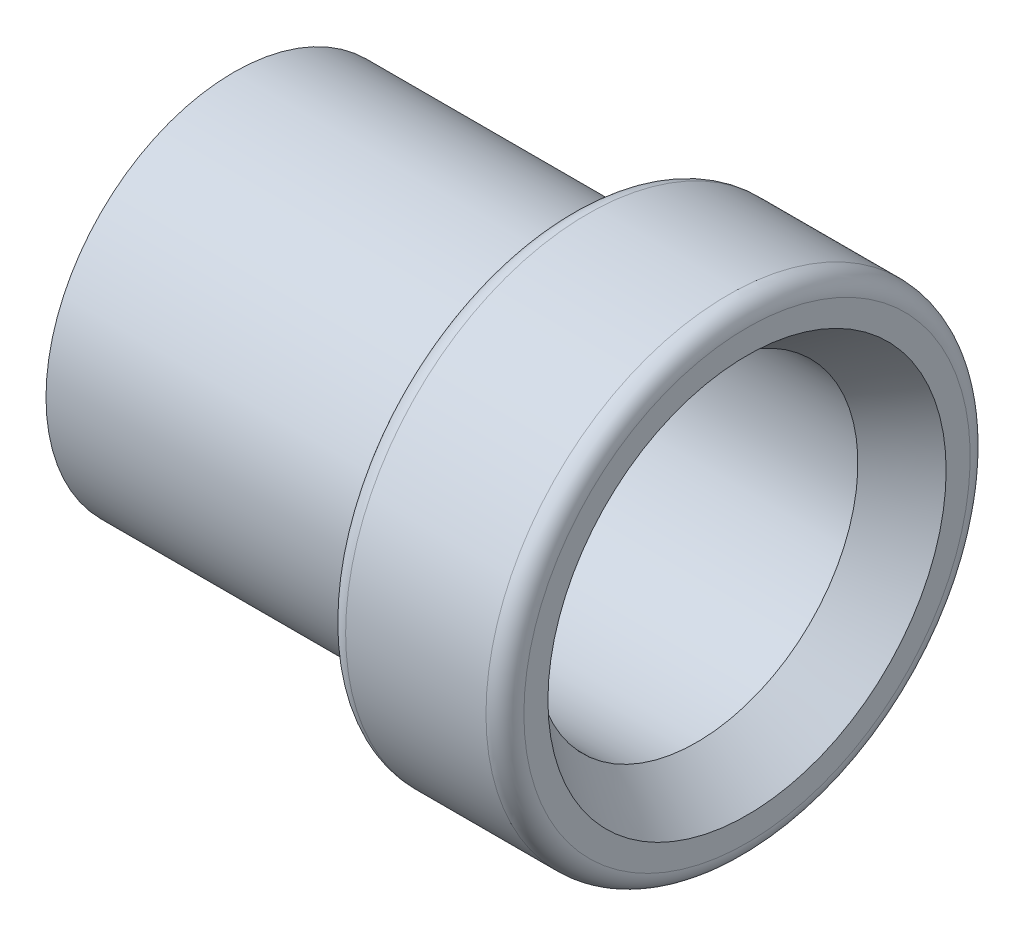
ISO-10303-21;
HEADER;
FILE_DESCRIPTION(('STEP AP214'),'2;1');
FILE_NAME('part.step','',(''),(''),'','','');
FILE_SCHEMA(('AUTOMOTIVE_DESIGN { 1 0 10303 214 1 1 1 1 }'));
ENDSEC;
DATA;
#1=APPLICATION_CONTEXT('core data for automotive mechanical design processes');
#2=APPLICATION_PROTOCOL_DEFINITION('international standard','automotive_design',2000,#1);
#3=PRODUCT_CONTEXT('',#1,'mechanical');
#4=PRODUCT('Part','Part','',(#3));
#5=PRODUCT_RELATED_PRODUCT_CATEGORY('part','',(#4));
#6=PRODUCT_DEFINITION_FORMATION('','',#4);
#7=PRODUCT_DEFINITION_CONTEXT('part definition',#1,'design');
#8=PRODUCT_DEFINITION('design','',#6,#7);
#9=PRODUCT_DEFINITION_SHAPE('','',#8);
#10=(LENGTH_UNIT() NAMED_UNIT(*) SI_UNIT(.MILLI.,.METRE.));
#11=(NAMED_UNIT(*) PLANE_ANGLE_UNIT() SI_UNIT($,.RADIAN.));
#12=(NAMED_UNIT(*) SI_UNIT($,.STERADIAN.) SOLID_ANGLE_UNIT());
#13=UNCERTAINTY_MEASURE_WITH_UNIT(LENGTH_MEASURE(1.E-05),#10,'distance_accuracy_value','');
#14=(GEOMETRIC_REPRESENTATION_CONTEXT(3) GLOBAL_UNCERTAINTY_ASSIGNED_CONTEXT((#13)) GLOBAL_UNIT_ASSIGNED_CONTEXT((#10,
#11,#12)) REPRESENTATION_CONTEXT('',''));
#15=CARTESIAN_POINT('',(0.,0.,0.));
#16=DIRECTION('',(0.,0.,1.));
#17=DIRECTION('',(1.,0.,0.));
#18=AXIS2_PLACEMENT_3D('',#15,#16,#17);
#19=CARTESIAN_POINT('',(-5.1562,3.2385,0.));
#20=DIRECTION('',(1.,0.,0.));
#21=DIRECTION('',(0.,0.,-1.));
#22=AXIS2_PLACEMENT_3D('',#19,#20,#21);
#23=PLANE('',#22);
#24=CARTESIAN_POINT('',(-5.1562,0.,0.));
#25=DIRECTION('',(-1.,0.,0.));
#26=DIRECTION('',(0.,0.,1.));
#27=AXIS2_PLACEMENT_3D('',#24,#25,#26);
#28=CIRCLE('',#27,3.2385);
#29=CARTESIAN_POINT('',(-5.1562,0.,3.2385));
#30=VERTEX_POINT('',#29);
#31=EDGE_CURVE('E10',#30,#30,#28,.T.);
#32=ORIENTED_EDGE('',*,*,#31,.F.);
#33=EDGE_LOOP('',(#32));
#34=FACE_BOUND('',#33,.T.);
#35=CARTESIAN_POINT('',(-5.1562,0.,0.));
#36=DIRECTION('',(-1.,0.,0.));
#37=DIRECTION('',(0.,0.,1.));
#38=AXIS2_PLACEMENT_3D('',#35,#36,#37);
#39=CIRCLE('',#38,3.7719);
#40=CARTESIAN_POINT('',(-5.1562,0.,3.7719));
#41=VERTEX_POINT('',#40);
#42=EDGE_CURVE('E61',#41,#41,#39,.T.);
#43=ORIENTED_EDGE('',*,*,#42,.T.);
#44=EDGE_LOOP('',(#43));
#45=FACE_BOUND('',#44,.T.);
#46=ADVANCED_FACE('F30',(#34,#45),#23,.F.);
#47=CARTESIAN_POINT('',(-5.1562,0.,0.));
#48=DIRECTION('',(-1.,0.,0.));
#49=DIRECTION('',(0.,0.,1.));
#50=AXIS2_PLACEMENT_3D('',#47,#48,#49);
#51=CYLINDRICAL_SURFACE('',#50,3.2385);
#52=CARTESIAN_POINT('',(4.14499184592525,0.,0.));
#53=DIRECTION('',(-1.,0.,0.));
#54=DIRECTION('',(0.,0.,1.));
#55=AXIS2_PLACEMENT_3D('',#52,#53,#54);
#56=CIRCLE('',#55,3.2385);
#57=CARTESIAN_POINT('',(4.14499184592525,0.,3.2385));
#58=VERTEX_POINT('',#57);
#59=EDGE_CURVE('E36',#58,#58,#56,.T.);
#60=ORIENTED_EDGE('',*,*,#59,.F.);
#61=EDGE_LOOP('',(#60));
#62=FACE_BOUND('',#61,.T.);
#63=ORIENTED_EDGE('',*,*,#31,.T.);
#64=EDGE_LOOP('',(#63));
#65=FACE_BOUND('',#64,.T.);
#66=ADVANCED_FACE('F104',(#62,#65),#51,.F.);
#67=CARTESIAN_POINT('',(4.14499184592525,0.,0.));
#68=DIRECTION('',(1.,0.,0.));
#69=DIRECTION('',(0.,0.,-1.));
#70=AXIS2_PLACEMENT_3D('',#67,#68,#69);
#71=CONICAL_SURFACE('',#70,3.2385,0.645771823237903);
#72=CARTESIAN_POINT('',(5.1562,0.,0.));
#73=DIRECTION('',(-1.,0.,0.));
#74=DIRECTION('',(0.,0.,1.));
#75=AXIS2_PLACEMENT_3D('',#72,#73,#74);
#76=CIRCLE('',#75,4.0005);
#77=CARTESIAN_POINT('',(5.1562,0.,4.0005));
#78=VERTEX_POINT('',#77);
#79=EDGE_CURVE('E40',#78,#78,#76,.T.);
#80=ORIENTED_EDGE('',*,*,#79,.F.);
#81=EDGE_LOOP('',(#80));
#82=FACE_BOUND('',#81,.T.);
#83=ORIENTED_EDGE('',*,*,#59,.T.);
#84=EDGE_LOOP('',(#83));
#85=FACE_BOUND('',#84,.T.);
#86=ADVANCED_FACE('F99',(#82,#85),#71,.F.);
#87=CARTESIAN_POINT('',(5.1562,4.0005,0.));
#88=DIRECTION('',(-1.,0.,0.));
#89=DIRECTION('',(0.,0.,1.));
#90=AXIS2_PLACEMENT_3D('',#87,#88,#89);
#91=PLANE('',#90);
#92=CARTESIAN_POINT('',(5.1562,0.,0.));
#93=DIRECTION('',(-1.,0.,0.));
#94=DIRECTION('',(0.,0.,1.));
#95=AXIS2_PLACEMENT_3D('',#92,#93,#94);
#96=CIRCLE('',#95,4.4831);
#97=CARTESIAN_POINT('',(5.1562,0.,4.4831));
#98=VERTEX_POINT('',#97);
#99=EDGE_CURVE('E44',#98,#98,#96,.T.);
#100=ORIENTED_EDGE('',*,*,#99,.F.);
#101=EDGE_LOOP('',(#100));
#102=FACE_BOUND('',#101,.T.);
#103=ORIENTED_EDGE('',*,*,#79,.T.);
#104=EDGE_LOOP('',(#103));
#105=FACE_BOUND('',#104,.T.);
#106=ADVANCED_FACE('F93',(#102,#105),#91,.F.);
#107=CARTESIAN_POINT('',(4.7752,0.,0.));
#108=DIRECTION('',(-1.,0.,0.));
#109=DIRECTION('',(0.,0.,1.));
#110=AXIS2_PLACEMENT_3D('',#107,#108,#109);
#111=TOROIDAL_SURFACE('',#110,4.4831,0.381000000000002);
#112=CARTESIAN_POINT('',(4.7752,0.,0.));
#113=DIRECTION('',(-1.,0.,0.));
#114=DIRECTION('',(0.,0.,1.));
#115=AXIS2_PLACEMENT_3D('',#112,#113,#114);
#116=CIRCLE('',#115,4.8641);
#117=CARTESIAN_POINT('',(4.7752,0.,4.8641));
#118=VERTEX_POINT('',#117);
#119=EDGE_CURVE('E49',#118,#118,#116,.T.);
#120=ORIENTED_EDGE('',*,*,#119,.F.);
#121=EDGE_LOOP('',(#120));
#122=FACE_BOUND('',#121,.T.);
#123=ORIENTED_EDGE('',*,*,#99,.T.);
#124=EDGE_LOOP('',(#123));
#125=FACE_BOUND('',#124,.T.);
#126=ADVANCED_FACE('F87',(#122,#125),#111,.T.);
#127=CARTESIAN_POINT('',(-5.1562,0.,0.));
#128=DIRECTION('',(-1.,0.,0.));
#129=DIRECTION('',(0.,0.,1.));
#130=AXIS2_PLACEMENT_3D('',#127,#128,#129);
#131=CYLINDRICAL_SURFACE('',#130,4.8641);
#132=CARTESIAN_POINT('',(1.9558,0.,0.));
#133=DIRECTION('',(-1.,0.,0.));
#134=DIRECTION('',(0.,0.,1.));
#135=AXIS2_PLACEMENT_3D('',#132,#133,#134);
#136=CIRCLE('',#135,4.8641);
#137=CARTESIAN_POINT('',(1.9558,0.,4.8641));
#138=VERTEX_POINT('',#137);
#139=EDGE_CURVE('E52',#138,#138,#136,.T.);
#140=ORIENTED_EDGE('',*,*,#139,.F.);
#141=EDGE_LOOP('',(#140));
#142=FACE_BOUND('',#141,.T.);
#143=ORIENTED_EDGE('',*,*,#119,.T.);
#144=EDGE_LOOP('',(#143));
#145=FACE_BOUND('',#144,.T.);
#146=ADVANCED_FACE('F81',(#142,#145),#131,.T.);
#147=CARTESIAN_POINT('',(1.9558,0.,0.));
#148=DIRECTION('',(-1.,0.,0.));
#149=DIRECTION('',(0.,0.,1.));
#150=AXIS2_PLACEMENT_3D('',#147,#148,#149);
#151=TOROIDAL_SURFACE('',#150,4.4831,0.381);
#152=CARTESIAN_POINT('',(1.5748,0.,0.));
#153=DIRECTION('',(-1.,0.,0.));
#154=DIRECTION('',(0.,0.,1.));
#155=AXIS2_PLACEMENT_3D('',#152,#153,#154);
#156=CIRCLE('',#155,4.4831);
#157=CARTESIAN_POINT('',(1.5748,0.,4.4831));
#158=VERTEX_POINT('',#157);
#159=EDGE_CURVE('E55',#158,#158,#156,.T.);
#160=ORIENTED_EDGE('',*,*,#159,.F.);
#161=EDGE_LOOP('',(#160));
#162=FACE_BOUND('',#161,.T.);
#163=ORIENTED_EDGE('',*,*,#139,.T.);
#164=EDGE_LOOP('',(#163));
#165=FACE_BOUND('',#164,.T.);
#166=ADVANCED_FACE('F75',(#162,#165),#151,.T.);
#167=CARTESIAN_POINT('',(1.5748,4.4831,0.));
#168=DIRECTION('',(1.,0.,0.));
#169=DIRECTION('',(0.,0.,-1.));
#170=AXIS2_PLACEMENT_3D('',#167,#168,#169);
#171=PLANE('',#170);
#172=CARTESIAN_POINT('',(1.5748,0.,0.));
#173=DIRECTION('',(-1.,0.,0.));
#174=DIRECTION('',(0.,0.,1.));
#175=AXIS2_PLACEMENT_3D('',#172,#173,#174);
#176=CIRCLE('',#175,3.7719);
#177=CARTESIAN_POINT('',(1.5748,0.,3.7719));
#178=VERTEX_POINT('',#177);
#179=EDGE_CURVE('E58',#178,#178,#176,.T.);
#180=ORIENTED_EDGE('',*,*,#179,.F.);
#181=EDGE_LOOP('',(#180));
#182=FACE_BOUND('',#181,.T.);
#183=ORIENTED_EDGE('',*,*,#159,.T.);
#184=EDGE_LOOP('',(#183));
#185=FACE_BOUND('',#184,.T.);
#186=ADVANCED_FACE('F69',(#182,#185),#171,.F.);
#187=CARTESIAN_POINT('',(-5.1562,0.,0.));
#188=DIRECTION('',(-1.,0.,0.));
#189=DIRECTION('',(0.,0.,1.));
#190=AXIS2_PLACEMENT_3D('',#187,#188,#189);
#191=CYLINDRICAL_SURFACE('',#190,3.7719);
#192=ORIENTED_EDGE('',*,*,#42,.F.);
#193=EDGE_LOOP('',(#192));
#194=FACE_BOUND('',#193,.T.);
#195=ORIENTED_EDGE('',*,*,#179,.T.);
#196=EDGE_LOOP('',(#195));
#197=FACE_BOUND('',#196,.T.);
#198=ADVANCED_FACE('F66',(#194,#197),#191,.T.);
#199=CLOSED_SHELL('',(#46,#66,#86,#106,#126,#146,#166,#186,#198));
#200=MANIFOLD_SOLID_BREP('B2',#199);
#201=ADVANCED_BREP_SHAPE_REPRESENTATION('',(#18,#200),#14);
#202=SHAPE_DEFINITION_REPRESENTATION(#9,#201);
ENDSEC;
END-ISO-10303-21;
